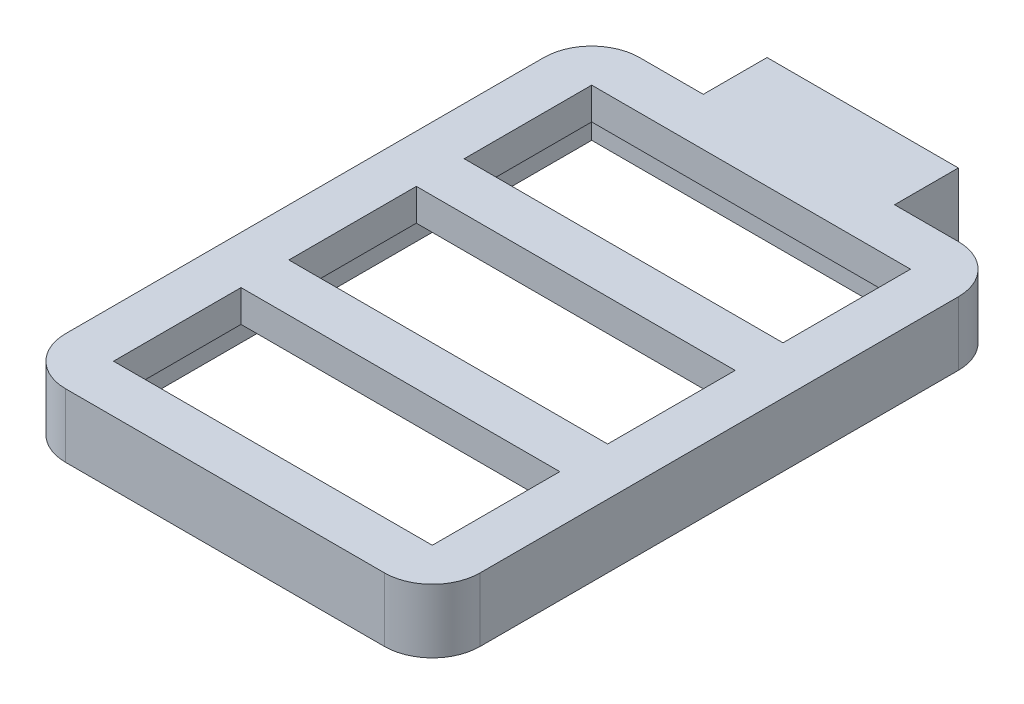
ISO-10303-21;
HEADER;
FILE_DESCRIPTION(('STEP AP214'),'2;1');
FILE_NAME('part.step','',(''),(''),'','','');
FILE_SCHEMA(('AUTOMOTIVE_DESIGN { 1 0 10303 214 1 1 1 1 }'));
ENDSEC;
DATA;
#1=APPLICATION_CONTEXT('core data for automotive mechanical design processes');
#2=APPLICATION_PROTOCOL_DEFINITION('international standard','automotive_design',2000,#1);
#3=PRODUCT_CONTEXT('',#1,'mechanical');
#4=PRODUCT('Part','Part','',(#3));
#5=PRODUCT_RELATED_PRODUCT_CATEGORY('part','',(#4));
#6=PRODUCT_DEFINITION_FORMATION('','',#4);
#7=PRODUCT_DEFINITION_CONTEXT('part definition',#1,'design');
#8=PRODUCT_DEFINITION('design','',#6,#7);
#9=PRODUCT_DEFINITION_SHAPE('','',#8);
#10=(LENGTH_UNIT() NAMED_UNIT(*) SI_UNIT(.MILLI.,.METRE.));
#11=(NAMED_UNIT(*) PLANE_ANGLE_UNIT() SI_UNIT($,.RADIAN.));
#12=(NAMED_UNIT(*) SI_UNIT($,.STERADIAN.) SOLID_ANGLE_UNIT());
#13=UNCERTAINTY_MEASURE_WITH_UNIT(LENGTH_MEASURE(1.E-05),#10,'distance_accuracy_value','');
#14=(GEOMETRIC_REPRESENTATION_CONTEXT(3) GLOBAL_UNCERTAINTY_ASSIGNED_CONTEXT((#13)) GLOBAL_UNIT_ASSIGNED_CONTEXT((#10,
#11,#12)) REPRESENTATION_CONTEXT('',''));
#15=CARTESIAN_POINT('',(0.,0.,0.));
#16=DIRECTION('',(0.,0.,1.));
#17=DIRECTION('',(1.,0.,0.));
#18=AXIS2_PLACEMENT_3D('',#15,#16,#17);
#19=CARTESIAN_POINT('',(50.,0.,0.));
#20=DIRECTION('',(-1.,0.,0.));
#21=DIRECTION('',(0.,0.,1.));
#22=AXIS2_PLACEMENT_3D('',#19,#20,#21);
#23=PLANE('',#22);
#24=DIRECTION('',(0.,1.,0.));
#25=VECTOR('',#24,1.);
#26=CARTESIAN_POINT('',(50.,0.,35.));
#27=LINE('',#26,#25);
#28=CARTESIAN_POINT('',(50.,10.,35.));
#29=VERTEX_POINT('',#28);
#30=CARTESIAN_POINT('',(50.,20.,35.));
#31=VERTEX_POINT('',#30);
#32=EDGE_CURVE('E333',#29,#31,#27,.T.);
#33=ORIENTED_EDGE('',*,*,#32,.F.);
#34=DIRECTION('',(0.,0.,1.));
#35=VECTOR('',#34,1.);
#36=CARTESIAN_POINT('',(50.,10.,0.));
#37=LINE('',#36,#35);
#38=CARTESIAN_POINT('',(50.,10.,75.));
#39=VERTEX_POINT('',#38);
#40=EDGE_CURVE('E56',#29,#39,#37,.T.);
#41=ORIENTED_EDGE('',*,*,#40,.T.);
#42=DIRECTION('',(0.,1.,0.));
#43=VECTOR('',#42,1.);
#44=CARTESIAN_POINT('',(50.,0.,75.));
#45=LINE('',#44,#43);
#46=CARTESIAN_POINT('',(50.,20.,75.));
#47=VERTEX_POINT('',#46);
#48=EDGE_CURVE('E334',#39,#47,#45,.T.);
#49=ORIENTED_EDGE('',*,*,#48,.T.);
#50=DIRECTION('',(0.,0.,1.));
#51=VECTOR('',#50,1.);
#52=CARTESIAN_POINT('',(50.,20.,0.));
#53=LINE('',#52,#51);
#54=EDGE_CURVE('E303',#31,#47,#53,.T.);
#55=ORIENTED_EDGE('',*,*,#54,.F.);
#56=EDGE_LOOP('',(#33,#41,#49,#55));
#57=FACE_BOUND('',#56,.T.);
#58=ADVANCED_FACE('F33',(#57),#23,.T.);
#59=CARTESIAN_POINT('',(0.,0.,75.));
#60=DIRECTION('',(0.,0.,1.));
#61=DIRECTION('',(1.,0.,0.));
#62=AXIS2_PLACEMENT_3D('',#59,#60,#61);
#63=PLANE('',#62);
#64=DIRECTION('',(1.,0.,0.));
#65=VECTOR('',#64,1.);
#66=CARTESIAN_POINT('',(0.,10.,75.));
#67=LINE('',#66,#65);
#68=CARTESIAN_POINT('',(-50.,10.,75.));
#69=VERTEX_POINT('',#68);
#70=EDGE_CURVE('E278',#69,#39,#67,.T.);
#71=ORIENTED_EDGE('',*,*,#70,.F.);
#72=DIRECTION('',(0.,1.,0.));
#73=VECTOR('',#72,1.);
#74=CARTESIAN_POINT('',(-50.,0.,75.));
#75=LINE('',#74,#73);
#76=CARTESIAN_POINT('',(-50.,20.,75.));
#77=VERTEX_POINT('',#76);
#78=EDGE_CURVE('E337',#69,#77,#75,.T.);
#79=ORIENTED_EDGE('',*,*,#78,.T.);
#80=DIRECTION('',(1.,0.,0.));
#81=VECTOR('',#80,1.);
#82=CARTESIAN_POINT('',(0.,20.,75.));
#83=LINE('',#82,#81);
#84=EDGE_CURVE('E330',#77,#47,#83,.T.);
#85=ORIENTED_EDGE('',*,*,#84,.T.);
#86=ORIENTED_EDGE('',*,*,#48,.F.);
#87=EDGE_LOOP('',(#71,#79,#85,#86));
#88=FACE_BOUND('',#87,.T.);
#89=ADVANCED_FACE('F495',(#88),#63,.F.);
#90=CARTESIAN_POINT('',(-50.,0.,0.));
#91=DIRECTION('',(-1.,0.,0.));
#92=DIRECTION('',(0.,0.,1.));
#93=AXIS2_PLACEMENT_3D('',#90,#91,#92);
#94=PLANE('',#93);
#95=DIRECTION('',(0.,0.,1.));
#96=VECTOR('',#95,1.);
#97=CARTESIAN_POINT('',(-50.,10.,0.));
#98=LINE('',#97,#96);
#99=CARTESIAN_POINT('',(-50.,10.,35.));
#100=VERTEX_POINT('',#99);
#101=EDGE_CURVE('E276',#100,#69,#98,.T.);
#102=ORIENTED_EDGE('',*,*,#101,.F.);
#103=DIRECTION('',(0.,1.,0.));
#104=VECTOR('',#103,1.);
#105=CARTESIAN_POINT('',(-50.,0.,35.));
#106=LINE('',#105,#104);
#107=CARTESIAN_POINT('',(-50.,20.,35.));
#108=VERTEX_POINT('',#107);
#109=EDGE_CURVE('E339',#100,#108,#106,.T.);
#110=ORIENTED_EDGE('',*,*,#109,.T.);
#111=DIRECTION('',(0.,0.,1.));
#112=VECTOR('',#111,1.);
#113=CARTESIAN_POINT('',(-50.,20.,0.));
#114=LINE('',#113,#112);
#115=EDGE_CURVE('E327',#108,#77,#114,.T.);
#116=ORIENTED_EDGE('',*,*,#115,.T.);
#117=ORIENTED_EDGE('',*,*,#78,.F.);
#118=EDGE_LOOP('',(#102,#110,#116,#117));
#119=FACE_BOUND('',#118,.T.);
#120=ADVANCED_FACE('F501',(#119),#94,.F.);
#121=CARTESIAN_POINT('',(0.,0.,35.));
#122=DIRECTION('',(0.,0.,1.));
#123=DIRECTION('',(1.,0.,0.));
#124=AXIS2_PLACEMENT_3D('',#121,#122,#123);
#125=PLANE('',#124);
#126=ORIENTED_EDGE('',*,*,#109,.F.);
#127=DIRECTION('',(1.,0.,0.));
#128=VECTOR('',#127,1.);
#129=CARTESIAN_POINT('',(0.,10.,35.));
#130=LINE('',#129,#128);
#131=EDGE_CURVE('E274',#100,#29,#130,.T.);
#132=ORIENTED_EDGE('',*,*,#131,.T.);
#133=ORIENTED_EDGE('',*,*,#32,.T.);
#134=DIRECTION('',(1.,0.,0.));
#135=VECTOR('',#134,1.);
#136=CARTESIAN_POINT('',(0.,20.,35.));
#137=LINE('',#136,#135);
#138=EDGE_CURVE('E324',#108,#31,#137,.T.);
#139=ORIENTED_EDGE('',*,*,#138,.F.);
#140=EDGE_LOOP('',(#126,#132,#133,#139));
#141=FACE_BOUND('',#140,.T.);
#142=ADVANCED_FACE('F507',(#141),#125,.T.);
#143=CARTESIAN_POINT('',(-50.,0.,-20.));
#144=DIRECTION('',(-1.,0.,0.));
#145=DIRECTION('',(0.,0.,1.));
#146=AXIS2_PLACEMENT_3D('',#143,#144,#145);
#147=PLANE('',#146);
#148=DIRECTION('',(0.,0.,1.));
#149=VECTOR('',#148,1.);
#150=CARTESIAN_POINT('',(-50.,10.,-20.));
#151=LINE('',#150,#149);
#152=CARTESIAN_POINT('',(-50.,10.,-20.));
#153=VERTEX_POINT('',#152);
#154=CARTESIAN_POINT('',(-50.,10.,20.));
#155=VERTEX_POINT('',#154);
#156=EDGE_CURVE('E272',#153,#155,#151,.T.);
#157=ORIENTED_EDGE('',*,*,#156,.F.);
#158=DIRECTION('',(0.,1.,0.));
#159=VECTOR('',#158,1.);
#160=CARTESIAN_POINT('',(-50.,0.,-20.));
#161=LINE('',#160,#159);
#162=CARTESIAN_POINT('',(-50.,20.,-20.));
#163=VERTEX_POINT('',#162);
#164=EDGE_CURVE('E281',#153,#163,#161,.T.);
#165=ORIENTED_EDGE('',*,*,#164,.T.);
#166=DIRECTION('',(0.,0.,1.));
#167=VECTOR('',#166,1.);
#168=CARTESIAN_POINT('',(-50.,20.,-20.));
#169=LINE('',#168,#167);
#170=CARTESIAN_POINT('',(-50.,20.,20.));
#171=VERTEX_POINT('',#170);
#172=EDGE_CURVE('E291',#163,#171,#169,.T.);
#173=ORIENTED_EDGE('',*,*,#172,.T.);
#174=DIRECTION('',(0.,1.,0.));
#175=VECTOR('',#174,1.);
#176=CARTESIAN_POINT('',(-50.,0.,20.));
#177=LINE('',#176,#175);
#178=EDGE_CURVE('E304',#155,#171,#177,.T.);
#179=ORIENTED_EDGE('',*,*,#178,.F.);
#180=EDGE_LOOP('',(#157,#165,#173,#179));
#181=FACE_BOUND('',#180,.T.);
#182=ADVANCED_FACE('F630',(#181),#147,.F.);
#183=CARTESIAN_POINT('',(-50.,0.,-20.));
#184=DIRECTION('',(0.,0.,1.));
#185=DIRECTION('',(1.,0.,0.));
#186=AXIS2_PLACEMENT_3D('',#183,#184,#185);
#187=PLANE('',#186);
#188=ORIENTED_EDGE('',*,*,#164,.F.);
#189=DIRECTION('',(1.,0.,0.));
#190=VECTOR('',#189,1.);
#191=CARTESIAN_POINT('',(-50.,10.,-20.));
#192=LINE('',#191,#190);
#193=CARTESIAN_POINT('',(50.,10.,-20.));
#194=VERTEX_POINT('',#193);
#195=EDGE_CURVE('E269',#153,#194,#192,.T.);
#196=ORIENTED_EDGE('',*,*,#195,.T.);
#197=DIRECTION('',(0.,1.,0.));
#198=VECTOR('',#197,1.);
#199=CARTESIAN_POINT('',(50.,0.,-20.));
#200=LINE('',#199,#198);
#201=CARTESIAN_POINT('',(50.,20.,-20.));
#202=VERTEX_POINT('',#201);
#203=EDGE_CURVE('E309',#194,#202,#200,.T.);
#204=ORIENTED_EDGE('',*,*,#203,.T.);
#205=DIRECTION('',(1.,0.,0.));
#206=VECTOR('',#205,1.);
#207=CARTESIAN_POINT('',(-50.,20.,-20.));
#208=LINE('',#207,#206);
#209=EDGE_CURVE('E306',#163,#202,#208,.T.);
#210=ORIENTED_EDGE('',*,*,#209,.F.);
#211=EDGE_LOOP('',(#188,#196,#204,#210));
#212=FACE_BOUND('',#211,.T.);
#213=ADVANCED_FACE('F638',(#212),#187,.T.);
#214=CARTESIAN_POINT('',(50.,0.,-20.));
#215=DIRECTION('',(-1.,0.,0.));
#216=DIRECTION('',(0.,0.,1.));
#217=AXIS2_PLACEMENT_3D('',#214,#215,#216);
#218=PLANE('',#217);
#219=ORIENTED_EDGE('',*,*,#203,.F.);
#220=DIRECTION('',(0.,0.,1.));
#221=VECTOR('',#220,1.);
#222=CARTESIAN_POINT('',(50.,10.,-20.));
#223=LINE('',#222,#221);
#224=CARTESIAN_POINT('',(50.,10.,20.));
#225=VERTEX_POINT('',#224);
#226=EDGE_CURVE('E266',#194,#225,#223,.T.);
#227=ORIENTED_EDGE('',*,*,#226,.T.);
#228=DIRECTION('',(0.,1.,0.));
#229=VECTOR('',#228,1.);
#230=CARTESIAN_POINT('',(50.,0.,20.));
#231=LINE('',#230,#229);
#232=CARTESIAN_POINT('',(50.,20.,20.));
#233=VERTEX_POINT('',#232);
#234=EDGE_CURVE('E307',#225,#233,#231,.T.);
#235=ORIENTED_EDGE('',*,*,#234,.T.);
#236=DIRECTION('',(0.,0.,1.));
#237=VECTOR('',#236,1.);
#238=CARTESIAN_POINT('',(50.,20.,-20.));
#239=LINE('',#238,#237);
#240=EDGE_CURVE('E314',#202,#233,#239,.T.);
#241=ORIENTED_EDGE('',*,*,#240,.F.);
#242=EDGE_LOOP('',(#219,#227,#235,#241));
#243=FACE_BOUND('',#242,.T.);
#244=ADVANCED_FACE('F647',(#243),#218,.T.);
#245=CARTESIAN_POINT('',(-50.,0.,20.));
#246=DIRECTION('',(0.,0.,1.));
#247=DIRECTION('',(1.,0.,0.));
#248=AXIS2_PLACEMENT_3D('',#245,#246,#247);
#249=PLANE('',#248);
#250=DIRECTION('',(1.,0.,0.));
#251=VECTOR('',#250,1.);
#252=CARTESIAN_POINT('',(-50.,10.,20.));
#253=LINE('',#252,#251);
#254=EDGE_CURVE('E264',#155,#225,#253,.T.);
#255=ORIENTED_EDGE('',*,*,#254,.F.);
#256=ORIENTED_EDGE('',*,*,#178,.T.);
#257=DIRECTION('',(1.,0.,0.));
#258=VECTOR('',#257,1.);
#259=CARTESIAN_POINT('',(-50.,20.,20.));
#260=LINE('',#259,#258);
#261=EDGE_CURVE('E317',#171,#233,#260,.T.);
#262=ORIENTED_EDGE('',*,*,#261,.T.);
#263=ORIENTED_EDGE('',*,*,#234,.F.);
#264=EDGE_LOOP('',(#255,#256,#262,#263));
#265=FACE_BOUND('',#264,.T.);
#266=ADVANCED_FACE('F656',(#265),#249,.F.);
#267=CARTESIAN_POINT('',(-50.,0.,-75.));
#268=DIRECTION('',(-1.,0.,0.));
#269=DIRECTION('',(0.,0.,1.));
#270=AXIS2_PLACEMENT_3D('',#267,#268,#269);
#271=PLANE('',#270);
#272=DIRECTION('',(0.,0.,1.));
#273=VECTOR('',#272,1.);
#274=CARTESIAN_POINT('',(-50.,10.,-75.));
#275=LINE('',#274,#273);
#276=CARTESIAN_POINT('',(-50.,10.,-75.));
#277=VERTEX_POINT('',#276);
#278=CARTESIAN_POINT('',(-50.,10.,-35.));
#279=VERTEX_POINT('',#278);
#280=EDGE_CURVE('E262',#277,#279,#275,.T.);
#281=ORIENTED_EDGE('',*,*,#280,.F.);
#282=DIRECTION('',(0.,1.,0.));
#283=VECTOR('',#282,1.);
#284=CARTESIAN_POINT('',(-50.,0.,-75.));
#285=LINE('',#284,#283);
#286=CARTESIAN_POINT('',(-50.,20.,-75.));
#287=VERTEX_POINT('',#286);
#288=EDGE_CURVE('E289',#277,#287,#285,.T.);
#289=ORIENTED_EDGE('',*,*,#288,.T.);
#290=DIRECTION('',(0.,0.,1.));
#291=VECTOR('',#290,1.);
#292=CARTESIAN_POINT('',(-50.,20.,-75.));
#293=LINE('',#292,#291);
#294=CARTESIAN_POINT('',(-50.,20.,-35.));
#295=VERTEX_POINT('',#294);
#296=EDGE_CURVE('E300',#287,#295,#293,.T.);
#297=ORIENTED_EDGE('',*,*,#296,.T.);
#298=DIRECTION('',(0.,1.,0.));
#299=VECTOR('',#298,1.);
#300=CARTESIAN_POINT('',(-50.,0.,-35.));
#301=LINE('',#300,#299);
#302=EDGE_CURVE('E282',#279,#295,#301,.T.);
#303=ORIENTED_EDGE('',*,*,#302,.F.);
#304=EDGE_LOOP('',(#281,#289,#297,#303));
#305=FACE_BOUND('',#304,.T.);
#306=ADVANCED_FACE('F665',(#305),#271,.F.);
#307=CARTESIAN_POINT('',(-50.,0.,-75.));
#308=DIRECTION('',(0.,0.,1.));
#309=DIRECTION('',(1.,0.,0.));
#310=AXIS2_PLACEMENT_3D('',#307,#308,#309);
#311=PLANE('',#310);
#312=ORIENTED_EDGE('',*,*,#288,.F.);
#313=DIRECTION('',(1.,0.,0.));
#314=VECTOR('',#313,1.);
#315=CARTESIAN_POINT('',(-50.,10.,-75.));
#316=LINE('',#315,#314);
#317=CARTESIAN_POINT('',(50.,10.,-75.));
#318=VERTEX_POINT('',#317);
#319=EDGE_CURVE('E259',#277,#318,#316,.T.);
#320=ORIENTED_EDGE('',*,*,#319,.T.);
#321=DIRECTION('',(0.,1.,0.));
#322=VECTOR('',#321,1.);
#323=CARTESIAN_POINT('',(50.,0.,-75.));
#324=LINE('',#323,#322);
#325=CARTESIAN_POINT('',(50.,20.,-75.));
#326=VERTEX_POINT('',#325);
#327=EDGE_CURVE('E287',#318,#326,#324,.T.);
#328=ORIENTED_EDGE('',*,*,#327,.T.);
#329=DIRECTION('',(1.,0.,0.));
#330=VECTOR('',#329,1.);
#331=CARTESIAN_POINT('',(-50.,20.,-75.));
#332=LINE('',#331,#330);
#333=EDGE_CURVE('E284',#287,#326,#332,.T.);
#334=ORIENTED_EDGE('',*,*,#333,.F.);
#335=EDGE_LOOP('',(#312,#320,#328,#334));
#336=FACE_BOUND('',#335,.T.);
#337=ADVANCED_FACE('F674',(#336),#311,.T.);
#338=CARTESIAN_POINT('',(50.,0.,-75.));
#339=DIRECTION('',(-1.,0.,0.));
#340=DIRECTION('',(0.,0.,1.));
#341=AXIS2_PLACEMENT_3D('',#338,#339,#340);
#342=PLANE('',#341);
#343=ORIENTED_EDGE('',*,*,#327,.F.);
#344=DIRECTION('',(0.,0.,1.));
#345=VECTOR('',#344,1.);
#346=CARTESIAN_POINT('',(50.,10.,-75.));
#347=LINE('',#346,#345);
#348=CARTESIAN_POINT('',(50.,10.,-35.));
#349=VERTEX_POINT('',#348);
#350=EDGE_CURVE('E253',#318,#349,#347,.T.);
#351=ORIENTED_EDGE('',*,*,#350,.T.);
#352=DIRECTION('',(0.,1.,0.));
#353=VECTOR('',#352,1.);
#354=CARTESIAN_POINT('',(50.,0.,-35.));
#355=LINE('',#354,#353);
#356=CARTESIAN_POINT('',(50.,20.,-35.));
#357=VERTEX_POINT('',#356);
#358=EDGE_CURVE('E285',#349,#357,#355,.T.);
#359=ORIENTED_EDGE('',*,*,#358,.T.);
#360=DIRECTION('',(0.,0.,1.));
#361=VECTOR('',#360,1.);
#362=CARTESIAN_POINT('',(50.,20.,-75.));
#363=LINE('',#362,#361);
#364=EDGE_CURVE('E294',#326,#357,#363,.T.);
#365=ORIENTED_EDGE('',*,*,#364,.F.);
#366=EDGE_LOOP('',(#343,#351,#359,#365));
#367=FACE_BOUND('',#366,.T.);
#368=ADVANCED_FACE('F683',(#367),#342,.T.);
#369=CARTESIAN_POINT('',(-50.,0.,-35.));
#370=DIRECTION('',(0.,0.,1.));
#371=DIRECTION('',(1.,0.,0.));
#372=AXIS2_PLACEMENT_3D('',#369,#370,#371);
#373=PLANE('',#372);
#374=DIRECTION('',(1.,0.,0.));
#375=VECTOR('',#374,1.);
#376=CARTESIAN_POINT('',(-50.,10.,-35.));
#377=LINE('',#376,#375);
#378=EDGE_CURVE('E11',#279,#349,#377,.T.);
#379=ORIENTED_EDGE('',*,*,#378,.F.);
#380=ORIENTED_EDGE('',*,*,#302,.T.);
#381=DIRECTION('',(1.,0.,0.));
#382=VECTOR('',#381,1.);
#383=CARTESIAN_POINT('',(-50.,20.,-35.));
#384=LINE('',#383,#382);
#385=EDGE_CURVE('E297',#295,#357,#384,.T.);
#386=ORIENTED_EDGE('',*,*,#385,.T.);
#387=ORIENTED_EDGE('',*,*,#358,.F.);
#388=EDGE_LOOP('',(#379,#380,#386,#387));
#389=FACE_BOUND('',#388,.T.);
#390=ADVANCED_FACE('F511',(#389),#373,.F.);
#391=CARTESIAN_POINT('',(0.,20.,0.));
#392=DIRECTION('',(0.,1.,0.));
#393=DIRECTION('',(0.,0.,1.));
#394=AXIS2_PLACEMENT_3D('',#391,#392,#393);
#395=PLANE('',#394);
#396=ORIENTED_EDGE('',*,*,#296,.F.);
#397=ORIENTED_EDGE('',*,*,#333,.T.);
#398=ORIENTED_EDGE('',*,*,#364,.T.);
#399=ORIENTED_EDGE('',*,*,#385,.F.);
#400=EDGE_LOOP('',(#396,#397,#398,#399));
#401=FACE_BOUND('',#400,.T.);
#402=ORIENTED_EDGE('',*,*,#172,.F.);
#403=ORIENTED_EDGE('',*,*,#209,.T.);
#404=ORIENTED_EDGE('',*,*,#240,.T.);
#405=ORIENTED_EDGE('',*,*,#261,.F.);
#406=EDGE_LOOP('',(#402,#403,#404,#405));
#407=FACE_BOUND('',#406,.T.);
#408=DIRECTION('',(0.,0.,1.));
#409=VECTOR('',#408,1.);
#410=CARTESIAN_POINT('',(-65.,20.,-90.));
#411=LINE('',#410,#409);
#412=CARTESIAN_POINT('',(-65.,20.,-74.9999999999999));
#413=VERTEX_POINT('',#412);
#414=CARTESIAN_POINT('',(-65.,20.,74.9999999999999));
#415=VERTEX_POINT('',#414);
#416=EDGE_CURVE('E353',#413,#415,#411,.T.);
#417=ORIENTED_EDGE('',*,*,#416,.T.);
#418=CARTESIAN_POINT('',(-50.,20.,75.));
#419=DIRECTION('',(0.,1.,0.));
#420=DIRECTION('',(0.,0.,1.));
#421=AXIS2_PLACEMENT_3D('',#418,#419,#420);
#422=CIRCLE('',#421,15.);
#423=CARTESIAN_POINT('',(-50.,20.,90.));
#424=VERTEX_POINT('',#423);
#425=EDGE_CURVE('E419',#415,#424,#422,.T.);
#426=ORIENTED_EDGE('',*,*,#425,.T.);
#427=DIRECTION('',(1.,0.,0.));
#428=VECTOR('',#427,1.);
#429=CARTESIAN_POINT('',(-65.,20.,90.));
#430=LINE('',#429,#428);
#431=CARTESIAN_POINT('',(50.,20.,90.));
#432=VERTEX_POINT('',#431);
#433=EDGE_CURVE('E356',#424,#432,#430,.T.);
#434=ORIENTED_EDGE('',*,*,#433,.T.);
#435=CARTESIAN_POINT('',(50.,20.,75.));
#436=DIRECTION('',(0.,1.,0.));
#437=DIRECTION('',(0.,0.,1.));
#438=AXIS2_PLACEMENT_3D('',#435,#436,#437);
#439=CIRCLE('',#438,15.);
#440=CARTESIAN_POINT('',(65.,20.,75.));
#441=VERTEX_POINT('',#440);
#442=EDGE_CURVE('E417',#432,#441,#439,.T.);
#443=ORIENTED_EDGE('',*,*,#442,.T.);
#444=DIRECTION('',(0.,0.,-1.));
#445=VECTOR('',#444,1.);
#446=CARTESIAN_POINT('',(65.,20.,90.));
#447=LINE('',#446,#445);
#448=CARTESIAN_POINT('',(65.,20.,-74.9999999999999));
#449=VERTEX_POINT('',#448);
#450=EDGE_CURVE('E359',#441,#449,#447,.T.);
#451=ORIENTED_EDGE('',*,*,#450,.T.);
#452=CARTESIAN_POINT('',(50.,20.,-75.));
#453=DIRECTION('',(0.,1.,0.));
#454=DIRECTION('',(0.,0.,1.));
#455=AXIS2_PLACEMENT_3D('',#452,#453,#454);
#456=CIRCLE('',#455,15.);
#457=CARTESIAN_POINT('',(50.,20.,-90.));
#458=VERTEX_POINT('',#457);
#459=EDGE_CURVE('E415',#449,#458,#456,.T.);
#460=ORIENTED_EDGE('',*,*,#459,.T.);
#461=DIRECTION('',(-1.,0.,0.));
#462=VECTOR('',#461,1.);
#463=CARTESIAN_POINT('',(65.,20.,-90.));
#464=LINE('',#463,#462);
#465=CARTESIAN_POINT('',(30.,20.,-90.));
#466=VERTEX_POINT('',#465);
#467=EDGE_CURVE('E362',#458,#466,#464,.T.);
#468=ORIENTED_EDGE('',*,*,#467,.T.);
#469=DIRECTION('',(0.,0.,-1.));
#470=VECTOR('',#469,1.);
#471=CARTESIAN_POINT('',(30.,20.,-90.));
#472=LINE('',#471,#470);
#473=CARTESIAN_POINT('',(30.,20.,-110.));
#474=VERTEX_POINT('',#473);
#475=EDGE_CURVE('E342',#466,#474,#472,.T.);
#476=ORIENTED_EDGE('',*,*,#475,.T.);
#477=DIRECTION('',(-1.,0.,0.));
#478=VECTOR('',#477,1.);
#479=CARTESIAN_POINT('',(30.,20.,-110.));
#480=LINE('',#479,#478);
#481=CARTESIAN_POINT('',(-30.,20.,-110.));
#482=VERTEX_POINT('',#481);
#483=EDGE_CURVE('E345',#474,#482,#480,.T.);
#484=ORIENTED_EDGE('',*,*,#483,.T.);
#485=DIRECTION('',(0.,0.,1.));
#486=VECTOR('',#485,1.);
#487=CARTESIAN_POINT('',(-30.,20.,-110.));
#488=LINE('',#487,#486);
#489=CARTESIAN_POINT('',(-30.,20.,-89.9999999999999));
#490=VERTEX_POINT('',#489);
#491=EDGE_CURVE('E348',#482,#490,#488,.T.);
#492=ORIENTED_EDGE('',*,*,#491,.T.);
#493=DIRECTION('',(-1.,0.,0.));
#494=VECTOR('',#493,1.);
#495=CARTESIAN_POINT('',(-30.,20.,-89.9999999999999));
#496=LINE('',#495,#494);
#497=CARTESIAN_POINT('',(-50.,20.,-89.9999999999999));
#498=VERTEX_POINT('',#497);
#499=EDGE_CURVE('E350',#490,#498,#496,.T.);
#500=ORIENTED_EDGE('',*,*,#499,.T.);
#501=CARTESIAN_POINT('',(-50.,20.,-74.9999999999999));
#502=DIRECTION('',(0.,1.,0.));
#503=DIRECTION('',(0.,0.,1.));
#504=AXIS2_PLACEMENT_3D('',#501,#502,#503);
#505=CIRCLE('',#504,15.);
#506=EDGE_CURVE('E413',#498,#413,#505,.T.);
#507=ORIENTED_EDGE('',*,*,#506,.T.);
#508=EDGE_LOOP('',(#417,#426,#434,#443,#451,#460,#468,#476,#484,#492,#500,#507));
#509=FACE_BOUND('',#508,.T.);
#510=ORIENTED_EDGE('',*,*,#138,.T.);
#511=ORIENTED_EDGE('',*,*,#54,.T.);
#512=ORIENTED_EDGE('',*,*,#84,.F.);
#513=ORIENTED_EDGE('',*,*,#115,.F.);
#514=EDGE_LOOP('',(#510,#511,#512,#513));
#515=FACE_BOUND('',#514,.T.);
#516=ADVANCED_FACE('F436',(#401,#407,#509,#515),#395,.T.);
#517=CARTESIAN_POINT('',(0.,0.,0.));
#518=DIRECTION('',(0.,1.,0.));
#519=DIRECTION('',(0.,0.,1.));
#520=AXIS2_PLACEMENT_3D('',#517,#518,#519);
#521=PLANE('',#520);
#522=DIRECTION('',(-1.,0.,0.));
#523=VECTOR('',#522,1.);
#524=CARTESIAN_POINT('',(-55.,0.,80.));
#525=LINE('',#524,#523);
#526=CARTESIAN_POINT('',(55.,0.,80.));
#527=VERTEX_POINT('',#526);
#528=CARTESIAN_POINT('',(-55.,0.,80.));
#529=VERTEX_POINT('',#528);
#530=EDGE_CURVE('E247',#527,#529,#525,.T.);
#531=ORIENTED_EDGE('',*,*,#530,.F.);
#532=DIRECTION('',(0.,0.,1.));
#533=VECTOR('',#532,1.);
#534=CARTESIAN_POINT('',(55.,0.,80.));
#535=LINE('',#534,#533);
#536=CARTESIAN_POINT('',(55.,0.,-80.));
#537=VERTEX_POINT('',#536);
#538=EDGE_CURVE('E48',#537,#527,#535,.T.);
#539=ORIENTED_EDGE('',*,*,#538,.F.);
#540=DIRECTION('',(1.,0.,0.));
#541=VECTOR('',#540,1.);
#542=CARTESIAN_POINT('',(-55.,0.,-80.));
#543=LINE('',#542,#541);
#544=CARTESIAN_POINT('',(-55.,0.,-80.));
#545=VERTEX_POINT('',#544);
#546=EDGE_CURVE('E238',#545,#537,#543,.T.);
#547=ORIENTED_EDGE('',*,*,#546,.F.);
#548=DIRECTION('',(0.,0.,-1.));
#549=VECTOR('',#548,1.);
#550=CARTESIAN_POINT('',(-55.,0.,80.));
#551=LINE('',#550,#549);
#552=EDGE_CURVE('E241',#529,#545,#551,.T.);
#553=ORIENTED_EDGE('',*,*,#552,.F.);
#554=EDGE_LOOP('',(#531,#539,#547,#553));
#555=FACE_BOUND('',#554,.T.);
#556=DIRECTION('',(1.,0.,0.));
#557=VECTOR('',#556,1.);
#558=CARTESIAN_POINT('',(-65.,0.,90.));
#559=LINE('',#558,#557);
#560=CARTESIAN_POINT('',(-50.,0.,90.));
#561=VERTEX_POINT('',#560);
#562=CARTESIAN_POINT('',(50.,0.,90.));
#563=VERTEX_POINT('',#562);
#564=EDGE_CURVE('E377',#561,#563,#559,.T.);
#565=ORIENTED_EDGE('',*,*,#564,.F.);
#566=CARTESIAN_POINT('',(-50.,0.,75.));
#567=DIRECTION('',(0.,1.,0.));
#568=DIRECTION('',(0.,0.,1.));
#569=AXIS2_PLACEMENT_3D('',#566,#567,#568);
#570=CIRCLE('',#569,15.);
#571=CARTESIAN_POINT('',(-65.,0.,74.9999999999999));
#572=VERTEX_POINT('',#571);
#573=EDGE_CURVE('E406',#561,#572,#570,.F.);
#574=ORIENTED_EDGE('',*,*,#573,.T.);
#575=DIRECTION('',(0.,0.,1.));
#576=VECTOR('',#575,1.);
#577=CARTESIAN_POINT('',(-65.,0.,-90.));
#578=LINE('',#577,#576);
#579=CARTESIAN_POINT('',(-65.,0.,-74.9999999999999));
#580=VERTEX_POINT('',#579);
#581=EDGE_CURVE('E374',#580,#572,#578,.T.);
#582=ORIENTED_EDGE('',*,*,#581,.F.);
#583=CARTESIAN_POINT('',(-50.,0.,-74.9999999999999));
#584=DIRECTION('',(0.,1.,0.));
#585=DIRECTION('',(0.,0.,1.));
#586=AXIS2_PLACEMENT_3D('',#583,#584,#585);
#587=CIRCLE('',#586,15.);
#588=CARTESIAN_POINT('',(-50.,0.,-89.9999999999999));
#589=VERTEX_POINT('',#588);
#590=EDGE_CURVE('E400',#580,#589,#587,.F.);
#591=ORIENTED_EDGE('',*,*,#590,.T.);
#592=DIRECTION('',(-1.,0.,0.));
#593=VECTOR('',#592,1.);
#594=CARTESIAN_POINT('',(-30.,0.,-89.9999999999999));
#595=LINE('',#594,#593);
#596=CARTESIAN_POINT('',(-30.,0.,-89.9999999999999));
#597=VERTEX_POINT('',#596);
#598=EDGE_CURVE('E371',#597,#589,#595,.T.);
#599=ORIENTED_EDGE('',*,*,#598,.F.);
#600=DIRECTION('',(0.,0.,1.));
#601=VECTOR('',#600,1.);
#602=CARTESIAN_POINT('',(-30.,0.,-110.));
#603=LINE('',#602,#601);
#604=CARTESIAN_POINT('',(-30.,0.,-110.));
#605=VERTEX_POINT('',#604);
#606=EDGE_CURVE('E369',#605,#597,#603,.T.);
#607=ORIENTED_EDGE('',*,*,#606,.F.);
#608=DIRECTION('',(-1.,0.,0.));
#609=VECTOR('',#608,1.);
#610=CARTESIAN_POINT('',(30.,0.,-110.));
#611=LINE('',#610,#609);
#612=CARTESIAN_POINT('',(30.,0.,-110.));
#613=VERTEX_POINT('',#612);
#614=EDGE_CURVE('E367',#613,#605,#611,.T.);
#615=ORIENTED_EDGE('',*,*,#614,.F.);
#616=DIRECTION('',(0.,0.,-1.));
#617=VECTOR('',#616,1.);
#618=CARTESIAN_POINT('',(30.,0.,-90.));
#619=LINE('',#618,#617);
#620=CARTESIAN_POINT('',(30.,0.,-90.));
#621=VERTEX_POINT('',#620);
#622=EDGE_CURVE('E336',#621,#613,#619,.T.);
#623=ORIENTED_EDGE('',*,*,#622,.F.);
#624=DIRECTION('',(-1.,0.,0.));
#625=VECTOR('',#624,1.);
#626=CARTESIAN_POINT('',(65.,0.,-90.));
#627=LINE('',#626,#625);
#628=CARTESIAN_POINT('',(50.,0.,-90.));
#629=VERTEX_POINT('',#628);
#630=EDGE_CURVE('E346',#629,#621,#627,.T.);
#631=ORIENTED_EDGE('',*,*,#630,.F.);
#632=CARTESIAN_POINT('',(50.,0.,-75.));
#633=DIRECTION('',(0.,1.,0.));
#634=DIRECTION('',(0.,0.,1.));
#635=AXIS2_PLACEMENT_3D('',#632,#633,#634);
#636=CIRCLE('',#635,15.);
#637=CARTESIAN_POINT('',(65.,0.,-74.9999999999999));
#638=VERTEX_POINT('',#637);
#639=EDGE_CURVE('E402',#629,#638,#636,.F.);
#640=ORIENTED_EDGE('',*,*,#639,.T.);
#641=DIRECTION('',(0.,0.,-1.));
#642=VECTOR('',#641,1.);
#643=CARTESIAN_POINT('',(65.,0.,90.));
#644=LINE('',#643,#642);
#645=CARTESIAN_POINT('',(65.,0.,75.));
#646=VERTEX_POINT('',#645);
#647=EDGE_CURVE('E380',#646,#638,#644,.T.);
#648=ORIENTED_EDGE('',*,*,#647,.F.);
#649=CARTESIAN_POINT('',(50.,0.,75.));
#650=DIRECTION('',(0.,1.,0.));
#651=DIRECTION('',(0.,0.,1.));
#652=AXIS2_PLACEMENT_3D('',#649,#650,#651);
#653=CIRCLE('',#652,15.);
#654=EDGE_CURVE('E404',#646,#563,#653,.F.);
#655=ORIENTED_EDGE('',*,*,#654,.T.);
#656=EDGE_LOOP('',(#565,#574,#582,#591,#599,#607,#615,#623,#631,#640,#648,#655));
#657=FACE_BOUND('',#656,.T.);
#658=ADVANCED_FACE('F448',(#555,#657),#521,.F.);
#659=CARTESIAN_POINT('',(30.,20.,-90.));
#660=DIRECTION('',(-1.,0.,0.));
#661=DIRECTION('',(0.,0.,1.));
#662=AXIS2_PLACEMENT_3D('',#659,#660,#661);
#663=PLANE('',#662);
#664=ORIENTED_EDGE('',*,*,#622,.T.);
#665=DIRECTION('',(0.,-1.,0.));
#666=VECTOR('',#665,1.);
#667=CARTESIAN_POINT('',(30.,20.,-110.));
#668=LINE('',#667,#666);
#669=EDGE_CURVE('E392',#474,#613,#668,.T.);
#670=ORIENTED_EDGE('',*,*,#669,.F.);
#671=ORIENTED_EDGE('',*,*,#475,.F.);
#672=DIRECTION('',(0.,-1.,0.));
#673=VECTOR('',#672,1.);
#674=CARTESIAN_POINT('',(30.,20.,-90.));
#675=LINE('',#674,#673);
#676=EDGE_CURVE('E364',#466,#621,#675,.T.);
#677=ORIENTED_EDGE('',*,*,#676,.T.);
#678=EDGE_LOOP('',(#664,#670,#671,#677));
#679=FACE_BOUND('',#678,.T.);
#680=ADVANCED_FACE('F480',(#679),#663,.F.);
#681=CARTESIAN_POINT('',(30.,20.,-110.));
#682=DIRECTION('',(0.,0.,1.));
#683=DIRECTION('',(1.,0.,0.));
#684=AXIS2_PLACEMENT_3D('',#681,#682,#683);
#685=PLANE('',#684);
#686=ORIENTED_EDGE('',*,*,#614,.T.);
#687=DIRECTION('',(0.,-1.,0.));
#688=VECTOR('',#687,1.);
#689=CARTESIAN_POINT('',(-30.,20.,-110.));
#690=LINE('',#689,#688);
#691=EDGE_CURVE('E389',#482,#605,#690,.T.);
#692=ORIENTED_EDGE('',*,*,#691,.F.);
#693=ORIENTED_EDGE('',*,*,#483,.F.);
#694=ORIENTED_EDGE('',*,*,#669,.T.);
#695=EDGE_LOOP('',(#686,#692,#693,#694));
#696=FACE_BOUND('',#695,.T.);
#697=ADVANCED_FACE('F482',(#696),#685,.F.);
#698=CARTESIAN_POINT('',(-30.,20.,-110.));
#699=DIRECTION('',(1.,0.,0.));
#700=DIRECTION('',(0.,0.,-1.));
#701=AXIS2_PLACEMENT_3D('',#698,#699,#700);
#702=PLANE('',#701);
#703=ORIENTED_EDGE('',*,*,#606,.T.);
#704=DIRECTION('',(0.,-1.,0.));
#705=VECTOR('',#704,1.);
#706=CARTESIAN_POINT('',(-30.,20.,-89.9999999999999));
#707=LINE('',#706,#705);
#708=EDGE_CURVE('E386',#490,#597,#707,.T.);
#709=ORIENTED_EDGE('',*,*,#708,.F.);
#710=ORIENTED_EDGE('',*,*,#491,.F.);
#711=ORIENTED_EDGE('',*,*,#691,.T.);
#712=EDGE_LOOP('',(#703,#709,#710,#711));
#713=FACE_BOUND('',#712,.T.);
#714=ADVANCED_FACE('F485',(#713),#702,.F.);
#715=CARTESIAN_POINT('',(-30.,20.,-89.9999999999999));
#716=DIRECTION('',(0.,0.,1.));
#717=DIRECTION('',(1.,0.,0.));
#718=AXIS2_PLACEMENT_3D('',#715,#716,#717);
#719=PLANE('',#718);
#720=ORIENTED_EDGE('',*,*,#598,.T.);
#721=DIRECTION('',(0.,-1.,0.));
#722=VECTOR('',#721,1.);
#723=CARTESIAN_POINT('',(-50.,20.,-89.9999999999999));
#724=LINE('',#723,#722);
#725=EDGE_CURVE('E41',#589,#498,#724,.F.);
#726=ORIENTED_EDGE('',*,*,#725,.T.);
#727=ORIENTED_EDGE('',*,*,#499,.F.);
#728=ORIENTED_EDGE('',*,*,#708,.T.);
#729=EDGE_LOOP('',(#720,#726,#727,#728));
#730=FACE_BOUND('',#729,.T.);
#731=ADVANCED_FACE('F431',(#730),#719,.F.);
#732=CARTESIAN_POINT('',(-65.,20.,-90.));
#733=DIRECTION('',(1.,0.,0.));
#734=DIRECTION('',(0.,0.,-1.));
#735=AXIS2_PLACEMENT_3D('',#732,#733,#734);
#736=PLANE('',#735);
#737=ORIENTED_EDGE('',*,*,#581,.T.);
#738=DIRECTION('',(0.,-1.,0.));
#739=VECTOR('',#738,1.);
#740=CARTESIAN_POINT('',(-65.,20.,75.));
#741=LINE('',#740,#739);
#742=EDGE_CURVE('E411',#572,#415,#741,.F.);
#743=ORIENTED_EDGE('',*,*,#742,.T.);
#744=ORIENTED_EDGE('',*,*,#416,.F.);
#745=DIRECTION('',(0.,-1.,0.));
#746=VECTOR('',#745,1.);
#747=CARTESIAN_POINT('',(-65.,20.,-74.9999999999999));
#748=LINE('',#747,#746);
#749=EDGE_CURVE('E408',#413,#580,#748,.T.);
#750=ORIENTED_EDGE('',*,*,#749,.T.);
#751=EDGE_LOOP('',(#737,#743,#744,#750));
#752=FACE_BOUND('',#751,.T.);
#753=ADVANCED_FACE('F444',(#752),#736,.F.);
#754=CARTESIAN_POINT('',(-65.,20.,90.));
#755=DIRECTION('',(0.,0.,-1.));
#756=DIRECTION('',(-1.,0.,0.));
#757=AXIS2_PLACEMENT_3D('',#754,#755,#756);
#758=PLANE('',#757);
#759=ORIENTED_EDGE('',*,*,#433,.F.);
#760=DIRECTION('',(0.,-1.,0.));
#761=VECTOR('',#760,1.);
#762=CARTESIAN_POINT('',(-50.,20.,90.));
#763=LINE('',#762,#761);
#764=EDGE_CURVE('E397',#424,#561,#763,.T.);
#765=ORIENTED_EDGE('',*,*,#764,.T.);
#766=ORIENTED_EDGE('',*,*,#564,.T.);
#767=DIRECTION('',(0.,-1.,0.));
#768=VECTOR('',#767,1.);
#769=CARTESIAN_POINT('',(50.,20.,90.));
#770=LINE('',#769,#768);
#771=EDGE_CURVE('E395',#563,#432,#770,.F.);
#772=ORIENTED_EDGE('',*,*,#771,.T.);
#773=EDGE_LOOP('',(#759,#765,#766,#772));
#774=FACE_BOUND('',#773,.T.);
#775=ADVANCED_FACE('F455',(#774),#758,.F.);
#776=CARTESIAN_POINT('',(65.,20.,90.));
#777=DIRECTION('',(-1.,0.,0.));
#778=DIRECTION('',(0.,0.,1.));
#779=AXIS2_PLACEMENT_3D('',#776,#777,#778);
#780=PLANE('',#779);
#781=ORIENTED_EDGE('',*,*,#450,.F.);
#782=DIRECTION('',(0.,-1.,0.));
#783=VECTOR('',#782,1.);
#784=CARTESIAN_POINT('',(65.,20.,75.));
#785=LINE('',#784,#783);
#786=EDGE_CURVE('E423',#441,#646,#785,.T.);
#787=ORIENTED_EDGE('',*,*,#786,.T.);
#788=ORIENTED_EDGE('',*,*,#647,.T.);
#789=DIRECTION('',(0.,-1.,0.));
#790=VECTOR('',#789,1.);
#791=CARTESIAN_POINT('',(65.,20.,-75.));
#792=LINE('',#791,#790);
#793=EDGE_CURVE('E421',#638,#449,#792,.F.);
#794=ORIENTED_EDGE('',*,*,#793,.T.);
#795=EDGE_LOOP('',(#781,#787,#788,#794));
#796=FACE_BOUND('',#795,.T.);
#797=ADVANCED_FACE('F464',(#796),#780,.F.);
#798=CARTESIAN_POINT('',(65.,20.,-90.));
#799=DIRECTION('',(0.,0.,1.));
#800=DIRECTION('',(1.,0.,0.));
#801=AXIS2_PLACEMENT_3D('',#798,#799,#800);
#802=PLANE('',#801);
#803=ORIENTED_EDGE('',*,*,#467,.F.);
#804=DIRECTION('',(0.,-1.,0.));
#805=VECTOR('',#804,1.);
#806=CARTESIAN_POINT('',(50.,20.,-90.));
#807=LINE('',#806,#805);
#808=EDGE_CURVE('E426',#458,#629,#807,.T.);
#809=ORIENTED_EDGE('',*,*,#808,.T.);
#810=ORIENTED_EDGE('',*,*,#630,.T.);
#811=ORIENTED_EDGE('',*,*,#676,.F.);
#812=EDGE_LOOP('',(#803,#809,#810,#811));
#813=FACE_BOUND('',#812,.T.);
#814=ADVANCED_FACE('F474',(#813),#802,.F.);
#815=CARTESIAN_POINT('',(-50.,20.,75.));
#816=DIRECTION('',(0.,-1.,0.));
#817=DIRECTION('',(0.,0.,-1.));
#818=AXIS2_PLACEMENT_3D('',#815,#816,#817);
#819=CYLINDRICAL_SURFACE('',#818,15.);
#820=ORIENTED_EDGE('',*,*,#425,.F.);
#821=ORIENTED_EDGE('',*,*,#742,.F.);
#822=ORIENTED_EDGE('',*,*,#573,.F.);
#823=ORIENTED_EDGE('',*,*,#764,.F.);
#824=EDGE_LOOP('',(#820,#821,#822,#823));
#825=FACE_BOUND('',#824,.T.);
#826=ADVANCED_FACE('F452',(#825),#819,.T.);
#827=CARTESIAN_POINT('',(50.,20.,75.));
#828=DIRECTION('',(0.,-1.,0.));
#829=DIRECTION('',(0.,0.,-1.));
#830=AXIS2_PLACEMENT_3D('',#827,#828,#829);
#831=CYLINDRICAL_SURFACE('',#830,15.);
#832=ORIENTED_EDGE('',*,*,#442,.F.);
#833=ORIENTED_EDGE('',*,*,#771,.F.);
#834=ORIENTED_EDGE('',*,*,#654,.F.);
#835=ORIENTED_EDGE('',*,*,#786,.F.);
#836=EDGE_LOOP('',(#832,#833,#834,#835));
#837=FACE_BOUND('',#836,.T.);
#838=ADVANCED_FACE('F461',(#837),#831,.T.);
#839=CARTESIAN_POINT('',(50.,20.,-75.));
#840=DIRECTION('',(0.,-1.,0.));
#841=DIRECTION('',(0.,0.,-1.));
#842=AXIS2_PLACEMENT_3D('',#839,#840,#841);
#843=CYLINDRICAL_SURFACE('',#842,15.);
#844=ORIENTED_EDGE('',*,*,#459,.F.);
#845=ORIENTED_EDGE('',*,*,#793,.F.);
#846=ORIENTED_EDGE('',*,*,#639,.F.);
#847=ORIENTED_EDGE('',*,*,#808,.F.);
#848=EDGE_LOOP('',(#844,#845,#846,#847));
#849=FACE_BOUND('',#848,.T.);
#850=ADVANCED_FACE('F471',(#849),#843,.T.);
#851=CARTESIAN_POINT('',(-50.,20.,-74.9999999999999));
#852=DIRECTION('',(0.,-1.,0.));
#853=DIRECTION('',(0.,0.,-1.));
#854=AXIS2_PLACEMENT_3D('',#851,#852,#853);
#855=CYLINDRICAL_SURFACE('',#854,15.);
#856=ORIENTED_EDGE('',*,*,#506,.F.);
#857=ORIENTED_EDGE('',*,*,#725,.F.);
#858=ORIENTED_EDGE('',*,*,#590,.F.);
#859=ORIENTED_EDGE('',*,*,#749,.F.);
#860=EDGE_LOOP('',(#856,#857,#858,#859));
#861=FACE_BOUND('',#860,.T.);
#862=ADVANCED_FACE('F35',(#861),#855,.T.);
#863=CARTESIAN_POINT('',(0.,10.,0.));
#864=DIRECTION('',(0.,-1.,0.));
#865=DIRECTION('',(0.,0.,-1.));
#866=AXIS2_PLACEMENT_3D('',#863,#864,#865);
#867=PLANE('',#866);
#868=ORIENTED_EDGE('',*,*,#131,.F.);
#869=ORIENTED_EDGE('',*,*,#101,.T.);
#870=ORIENTED_EDGE('',*,*,#70,.T.);
#871=ORIENTED_EDGE('',*,*,#40,.F.);
#872=EDGE_LOOP('',(#868,#869,#870,#871));
#873=FACE_BOUND('',#872,.T.);
#874=ORIENTED_EDGE('',*,*,#280,.T.);
#875=ORIENTED_EDGE('',*,*,#378,.T.);
#876=ORIENTED_EDGE('',*,*,#350,.F.);
#877=ORIENTED_EDGE('',*,*,#319,.F.);
#878=EDGE_LOOP('',(#874,#875,#876,#877));
#879=FACE_BOUND('',#878,.T.);
#880=DIRECTION('',(0.,0.,1.));
#881=VECTOR('',#880,1.);
#882=CARTESIAN_POINT('',(55.,10.,80.));
#883=LINE('',#882,#881);
#884=CARTESIAN_POINT('',(55.,10.,-80.));
#885=VERTEX_POINT('',#884);
#886=CARTESIAN_POINT('',(55.,10.,80.));
#887=VERTEX_POINT('',#886);
#888=EDGE_CURVE('E219',#885,#887,#883,.T.);
#889=ORIENTED_EDGE('',*,*,#888,.T.);
#890=DIRECTION('',(-1.,0.,0.));
#891=VECTOR('',#890,1.);
#892=CARTESIAN_POINT('',(-55.,10.,80.));
#893=LINE('',#892,#891);
#894=CARTESIAN_POINT('',(-55.,10.,80.));
#895=VERTEX_POINT('',#894);
#896=EDGE_CURVE('E228',#887,#895,#893,.T.);
#897=ORIENTED_EDGE('',*,*,#896,.T.);
#898=DIRECTION('',(0.,0.,-1.));
#899=VECTOR('',#898,1.);
#900=CARTESIAN_POINT('',(-55.,10.,80.));
#901=LINE('',#900,#899);
#902=CARTESIAN_POINT('',(-55.,10.,-80.));
#903=VERTEX_POINT('',#902);
#904=EDGE_CURVE('E233',#895,#903,#901,.T.);
#905=ORIENTED_EDGE('',*,*,#904,.T.);
#906=DIRECTION('',(1.,0.,0.));
#907=VECTOR('',#906,1.);
#908=CARTESIAN_POINT('',(-55.,10.,-80.));
#909=LINE('',#908,#907);
#910=EDGE_CURVE('E225',#903,#885,#909,.T.);
#911=ORIENTED_EDGE('',*,*,#910,.T.);
#912=EDGE_LOOP('',(#889,#897,#905,#911));
#913=FACE_BOUND('',#912,.T.);
#914=ORIENTED_EDGE('',*,*,#156,.T.);
#915=ORIENTED_EDGE('',*,*,#254,.T.);
#916=ORIENTED_EDGE('',*,*,#226,.F.);
#917=ORIENTED_EDGE('',*,*,#195,.F.);
#918=EDGE_LOOP('',(#914,#915,#916,#917));
#919=FACE_BOUND('',#918,.T.);
#920=ADVANCED_FACE('F235',(#873,#879,#913,#919),#867,.T.);
#921=CARTESIAN_POINT('',(55.,10.,80.));
#922=DIRECTION('',(1.,0.,0.));
#923=DIRECTION('',(0.,0.,-1.));
#924=AXIS2_PLACEMENT_3D('',#921,#922,#923);
#925=PLANE('',#924);
#926=ORIENTED_EDGE('',*,*,#538,.T.);
#927=DIRECTION('',(0.,-1.,0.));
#928=VECTOR('',#927,1.);
#929=CARTESIAN_POINT('',(55.,10.,80.));
#930=LINE('',#929,#928);
#931=EDGE_CURVE('E215',#887,#527,#930,.T.);
#932=ORIENTED_EDGE('',*,*,#931,.F.);
#933=ORIENTED_EDGE('',*,*,#888,.F.);
#934=DIRECTION('',(0.,-1.,0.));
#935=VECTOR('',#934,1.);
#936=CARTESIAN_POINT('',(55.,10.,-80.));
#937=LINE('',#936,#935);
#938=EDGE_CURVE('E251',#885,#537,#937,.T.);
#939=ORIENTED_EDGE('',*,*,#938,.T.);
#940=EDGE_LOOP('',(#926,#932,#933,#939));
#941=FACE_BOUND('',#940,.T.);
#942=ADVANCED_FACE('F217',(#941),#925,.F.);
#943=CARTESIAN_POINT('',(-55.,10.,-80.));
#944=DIRECTION('',(0.,0.,-1.));
#945=DIRECTION('',(-1.,0.,0.));
#946=AXIS2_PLACEMENT_3D('',#943,#944,#945);
#947=PLANE('',#946);
#948=ORIENTED_EDGE('',*,*,#546,.T.);
#949=ORIENTED_EDGE('',*,*,#938,.F.);
#950=ORIENTED_EDGE('',*,*,#910,.F.);
#951=DIRECTION('',(0.,-1.,0.));
#952=VECTOR('',#951,1.);
#953=CARTESIAN_POINT('',(-55.,10.,-80.));
#954=LINE('',#953,#952);
#955=EDGE_CURVE('E254',#903,#545,#954,.T.);
#956=ORIENTED_EDGE('',*,*,#955,.T.);
#957=EDGE_LOOP('',(#948,#949,#950,#956));
#958=FACE_BOUND('',#957,.T.);
#959=ADVANCED_FACE('F574',(#958),#947,.F.);
#960=CARTESIAN_POINT('',(-55.,10.,80.));
#961=DIRECTION('',(-1.,0.,0.));
#962=DIRECTION('',(0.,0.,1.));
#963=AXIS2_PLACEMENT_3D('',#960,#961,#962);
#964=PLANE('',#963);
#965=ORIENTED_EDGE('',*,*,#552,.T.);
#966=ORIENTED_EDGE('',*,*,#955,.F.);
#967=ORIENTED_EDGE('',*,*,#904,.F.);
#968=DIRECTION('',(0.,-1.,0.));
#969=VECTOR('',#968,1.);
#970=CARTESIAN_POINT('',(-55.,10.,80.));
#971=LINE('',#970,#969);
#972=EDGE_CURVE('E224',#895,#529,#971,.T.);
#973=ORIENTED_EDGE('',*,*,#972,.T.);
#974=EDGE_LOOP('',(#965,#966,#967,#973));
#975=FACE_BOUND('',#974,.T.);
#976=ADVANCED_FACE('F581',(#975),#964,.F.);
#977=CARTESIAN_POINT('',(-55.,10.,80.));
#978=DIRECTION('',(0.,0.,1.));
#979=DIRECTION('',(1.,0.,0.));
#980=AXIS2_PLACEMENT_3D('',#977,#978,#979);
#981=PLANE('',#980);
#982=ORIENTED_EDGE('',*,*,#530,.T.);
#983=ORIENTED_EDGE('',*,*,#972,.F.);
#984=ORIENTED_EDGE('',*,*,#896,.F.);
#985=ORIENTED_EDGE('',*,*,#931,.T.);
#986=EDGE_LOOP('',(#982,#983,#984,#985));
#987=FACE_BOUND('',#986,.T.);
#988=ADVANCED_FACE('F229',(#987),#981,.F.);
#989=CLOSED_SHELL('',(#58,#89,#120,#142,#182,#213,#244,#266,#306,#337,#368,#390,#516,#658,#680,
#697,#714,#731,#753,#775,#797,#814,#826,#838,#850,#862,#920,#942,#959,#976,#988));
#990=MANIFOLD_SOLID_BREP('B2',#989);
#991=ADVANCED_BREP_SHAPE_REPRESENTATION('',(#18,#990),#14);
#992=SHAPE_DEFINITION_REPRESENTATION(#9,#991);
ENDSEC;
END-ISO-10303-21;
